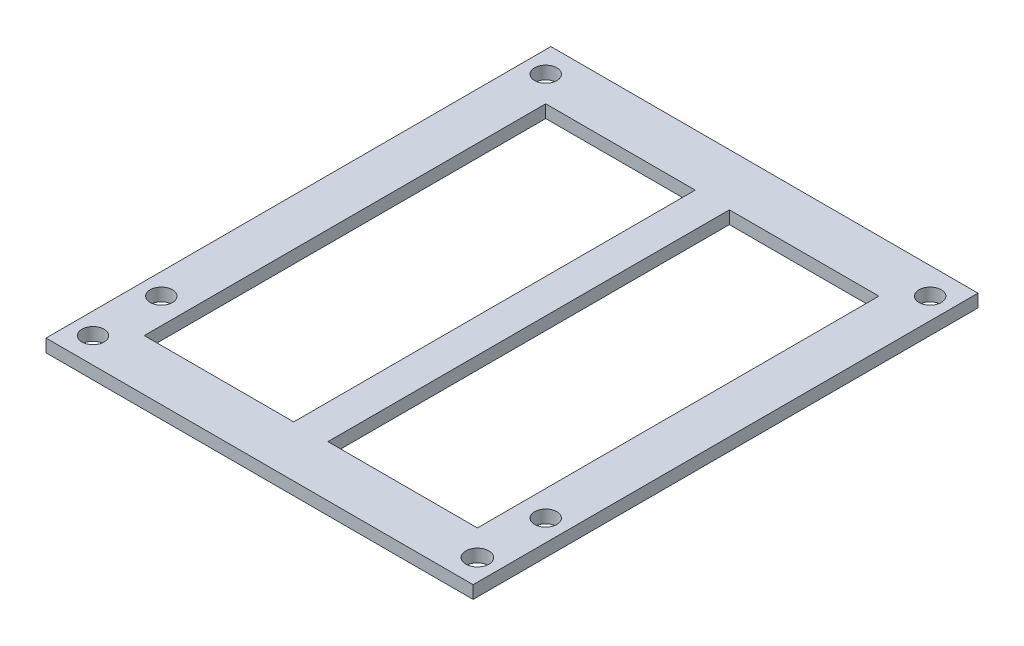
ISO-10303-21;
HEADER;
FILE_DESCRIPTION(('STEP AP214'),'2;1');
FILE_NAME('part.step','',(''),(''),'','','');
FILE_SCHEMA(('AUTOMOTIVE_DESIGN { 1 0 10303 214 1 1 1 1 }'));
ENDSEC;
DATA;
#1=APPLICATION_CONTEXT('core data for automotive mechanical design processes');
#2=APPLICATION_PROTOCOL_DEFINITION('international standard','automotive_design',2000,#1);
#3=PRODUCT_CONTEXT('',#1,'mechanical');
#4=PRODUCT('Part','Part','',(#3));
#5=PRODUCT_RELATED_PRODUCT_CATEGORY('part','',(#4));
#6=PRODUCT_DEFINITION_FORMATION('','',#4);
#7=PRODUCT_DEFINITION_CONTEXT('part definition',#1,'design');
#8=PRODUCT_DEFINITION('design','',#6,#7);
#9=PRODUCT_DEFINITION_SHAPE('','',#8);
#10=(LENGTH_UNIT() NAMED_UNIT(*) SI_UNIT(.MILLI.,.METRE.));
#11=(NAMED_UNIT(*) PLANE_ANGLE_UNIT() SI_UNIT($,.RADIAN.));
#12=(NAMED_UNIT(*) SI_UNIT($,.STERADIAN.) SOLID_ANGLE_UNIT());
#13=UNCERTAINTY_MEASURE_WITH_UNIT(LENGTH_MEASURE(1.E-05),#10,'distance_accuracy_value','');
#14=(GEOMETRIC_REPRESENTATION_CONTEXT(3) GLOBAL_UNCERTAINTY_ASSIGNED_CONTEXT((#13)) GLOBAL_UNIT_ASSIGNED_CONTEXT((#10,
#11,#12)) REPRESENTATION_CONTEXT('',''));
#15=CARTESIAN_POINT('',(0.,0.,0.));
#16=DIRECTION('',(0.,0.,1.));
#17=DIRECTION('',(1.,0.,0.));
#18=AXIS2_PLACEMENT_3D('',#15,#16,#17);
#19=CARTESIAN_POINT('',(0.,1.5,0.));
#20=DIRECTION('',(0.,-1.,0.));
#21=DIRECTION('',(0.,0.,-1.));
#22=AXIS2_PLACEMENT_3D('',#19,#20,#21);
#23=PLANE('',#22);
#24=CARTESIAN_POINT('',(22.5,1.5,-53.));
#25=DIRECTION('',(0.,1.,0.));
#26=DIRECTION('',(0.,0.,1.));
#27=AXIS2_PLACEMENT_3D('',#24,#25,#26);
#28=CIRCLE('',#27,1.3);
#29=CARTESIAN_POINT('',(22.5,1.5,-51.7));
#30=VERTEX_POINT('',#29);
#31=EDGE_CURVE('E160',#30,#30,#28,.T.);
#32=ORIENTED_EDGE('',*,*,#31,.F.);
#33=EDGE_LOOP('',(#32));
#34=FACE_BOUND('',#33,.T.);
#35=CARTESIAN_POINT('',(-22.5,1.5,-53.));
#36=DIRECTION('',(0.,1.,0.));
#37=DIRECTION('',(0.,0.,1.));
#38=AXIS2_PLACEMENT_3D('',#35,#36,#37);
#39=CIRCLE('',#38,1.3);
#40=CARTESIAN_POINT('',(-22.5,1.5,-51.7));
#41=VERTEX_POINT('',#40);
#42=EDGE_CURVE('E166',#41,#41,#39,.T.);
#43=ORIENTED_EDGE('',*,*,#42,.F.);
#44=EDGE_LOOP('',(#43));
#45=FACE_BOUND('',#44,.T.);
#46=CARTESIAN_POINT('',(22.5,1.5,-8.));
#47=DIRECTION('',(0.,1.,0.));
#48=DIRECTION('',(0.,0.,1.));
#49=AXIS2_PLACEMENT_3D('',#46,#47,#48);
#50=CIRCLE('',#49,1.3);
#51=CARTESIAN_POINT('',(22.5,1.5,-6.7));
#52=VERTEX_POINT('',#51);
#53=EDGE_CURVE('E172',#52,#52,#50,.T.);
#54=ORIENTED_EDGE('',*,*,#53,.F.);
#55=EDGE_LOOP('',(#54));
#56=FACE_BOUND('',#55,.T.);
#57=CARTESIAN_POINT('',(-22.5,1.5,-8.));
#58=DIRECTION('',(0.,1.,0.));
#59=DIRECTION('',(0.,0.,1.));
#60=AXIS2_PLACEMENT_3D('',#57,#58,#59);
#61=CIRCLE('',#60,1.3);
#62=CARTESIAN_POINT('',(-22.5,1.5,-6.7));
#63=VERTEX_POINT('',#62);
#64=EDGE_CURVE('E178',#63,#63,#61,.T.);
#65=ORIENTED_EDGE('',*,*,#64,.F.);
#66=EDGE_LOOP('',(#65));
#67=FACE_BOUND('',#66,.T.);
#68=DIRECTION('',(1.,0.,0.));
#69=VECTOR('',#68,1.);
#70=CARTESIAN_POINT('',(-19.5,1.5,-3.));
#71=LINE('',#70,#69);
#72=CARTESIAN_POINT('',(-19.5,1.5,-3.));
#73=VERTEX_POINT('',#72);
#74=CARTESIAN_POINT('',(-2.,1.5,-3.));
#75=VERTEX_POINT('',#74);
#76=EDGE_CURVE('E184',#73,#75,#71,.T.);
#77=ORIENTED_EDGE('',*,*,#76,.F.);
#78=DIRECTION('',(0.,0.,1.));
#79=VECTOR('',#78,1.);
#80=CARTESIAN_POINT('',(-19.5,1.5,-3.));
#81=LINE('',#80,#79);
#82=CARTESIAN_POINT('',(-19.5,1.5,-50.));
#83=VERTEX_POINT('',#82);
#84=EDGE_CURVE('E192',#83,#73,#81,.T.);
#85=ORIENTED_EDGE('',*,*,#84,.F.);
#86=DIRECTION('',(-1.,0.,0.));
#87=VECTOR('',#86,1.);
#88=CARTESIAN_POINT('',(-2.,1.5,-50.));
#89=LINE('',#88,#87);
#90=CARTESIAN_POINT('',(-2.,1.5,-50.));
#91=VERTEX_POINT('',#90);
#92=EDGE_CURVE('E189',#91,#83,#89,.T.);
#93=ORIENTED_EDGE('',*,*,#92,.F.);
#94=DIRECTION('',(0.,0.,-1.));
#95=VECTOR('',#94,1.);
#96=CARTESIAN_POINT('',(-2.,1.5,-50.));
#97=LINE('',#96,#95);
#98=EDGE_CURVE('E186',#75,#91,#97,.T.);
#99=ORIENTED_EDGE('',*,*,#98,.F.);
#100=EDGE_LOOP('',(#77,#85,#93,#99));
#101=FACE_BOUND('',#100,.T.);
#102=DIRECTION('',(0.,0.,-1.));
#103=VECTOR('',#102,1.);
#104=CARTESIAN_POINT('',(25.,1.5,-56.1033523698713));
#105=LINE('',#104,#103);
#106=CARTESIAN_POINT('',(25.,1.5,3.));
#107=VERTEX_POINT('',#106);
#108=CARTESIAN_POINT('',(25.,1.5,-56.1033523698713));
#109=VERTEX_POINT('',#108);
#110=EDGE_CURVE('E227',#107,#109,#105,.T.);
#111=ORIENTED_EDGE('',*,*,#110,.T.);
#112=DIRECTION('',(-1.,0.,0.));
#113=VECTOR('',#112,1.);
#114=CARTESIAN_POINT('',(-25.,1.5,-56.1033523698713));
#115=LINE('',#114,#113);
#116=CARTESIAN_POINT('',(-25.,1.5,-56.1033523698713));
#117=VERTEX_POINT('',#116);
#118=EDGE_CURVE('E230',#109,#117,#115,.T.);
#119=ORIENTED_EDGE('',*,*,#118,.T.);
#120=DIRECTION('',(0.,0.,1.));
#121=VECTOR('',#120,1.);
#122=CARTESIAN_POINT('',(-25.,1.5,-11.));
#123=LINE('',#122,#121);
#124=CARTESIAN_POINT('',(-25.,1.5,3.00000000000001));
#125=VERTEX_POINT('',#124);
#126=EDGE_CURVE('E233',#117,#125,#123,.T.);
#127=ORIENTED_EDGE('',*,*,#126,.T.);
#128=DIRECTION('',(1.,0.,0.));
#129=VECTOR('',#128,1.);
#130=CARTESIAN_POINT('',(25.,1.5,3.));
#131=LINE('',#130,#129);
#132=EDGE_CURVE('E235',#125,#107,#131,.T.);
#133=ORIENTED_EDGE('',*,*,#132,.T.);
#134=EDGE_LOOP('',(#111,#119,#127,#133));
#135=FACE_BOUND('',#134,.T.);
#136=CARTESIAN_POINT('',(22.5,1.5,0.));
#137=DIRECTION('',(0.,1.,0.));
#138=DIRECTION('',(0.,0.,1.));
#139=AXIS2_PLACEMENT_3D('',#136,#137,#138);
#140=CIRCLE('',#139,1.35);
#141=CARTESIAN_POINT('',(22.5,1.5,1.35));
#142=VERTEX_POINT('',#141);
#143=EDGE_CURVE('E221',#142,#142,#140,.T.);
#144=ORIENTED_EDGE('',*,*,#143,.F.);
#145=EDGE_LOOP('',(#144));
#146=FACE_BOUND('',#145,.T.);
#147=CARTESIAN_POINT('',(-22.5,1.5,0.));
#148=DIRECTION('',(0.,1.,0.));
#149=DIRECTION('',(0.,0.,1.));
#150=AXIS2_PLACEMENT_3D('',#147,#148,#149);
#151=CIRCLE('',#150,1.3);
#152=CARTESIAN_POINT('',(-22.5,1.5,1.3));
#153=VERTEX_POINT('',#152);
#154=EDGE_CURVE('E215',#153,#153,#151,.T.);
#155=ORIENTED_EDGE('',*,*,#154,.F.);
#156=EDGE_LOOP('',(#155));
#157=FACE_BOUND('',#156,.T.);
#158=DIRECTION('',(0.,0.,1.));
#159=VECTOR('',#158,1.);
#160=CARTESIAN_POINT('',(2.,1.5,-3.));
#161=LINE('',#160,#159);
#162=CARTESIAN_POINT('',(2.,1.5,-50.));
#163=VERTEX_POINT('',#162);
#164=CARTESIAN_POINT('',(2.,1.5,-3.));
#165=VERTEX_POINT('',#164);
#166=EDGE_CURVE('E124',#163,#165,#161,.T.);
#167=ORIENTED_EDGE('',*,*,#166,.F.);
#168=DIRECTION('',(-1.,0.,0.));
#169=VECTOR('',#168,1.);
#170=CARTESIAN_POINT('',(2.,1.5,-50.));
#171=LINE('',#170,#169);
#172=CARTESIAN_POINT('',(19.5,1.5,-50.));
#173=VERTEX_POINT('',#172);
#174=EDGE_CURVE('E146',#173,#163,#171,.T.);
#175=ORIENTED_EDGE('',*,*,#174,.F.);
#176=DIRECTION('',(0.,0.,-1.));
#177=VECTOR('',#176,1.);
#178=CARTESIAN_POINT('',(19.5,1.5,-3.));
#179=LINE('',#178,#177);
#180=CARTESIAN_POINT('',(19.5,1.5,-3.));
#181=VERTEX_POINT('',#180);
#182=EDGE_CURVE('E144',#181,#173,#179,.T.);
#183=ORIENTED_EDGE('',*,*,#182,.F.);
#184=DIRECTION('',(1.,0.,0.));
#185=VECTOR('',#184,1.);
#186=CARTESIAN_POINT('',(2.,1.5,-3.));
#187=LINE('',#186,#185);
#188=EDGE_CURVE('E132',#165,#181,#187,.T.);
#189=ORIENTED_EDGE('',*,*,#188,.F.);
#190=EDGE_LOOP('',(#167,#175,#183,#189));
#191=FACE_BOUND('',#190,.T.);
#192=ADVANCED_FACE('F35',(#34,#45,#56,#67,#101,#135,#146,#157,#191),#23,.F.);
#193=CARTESIAN_POINT('',(0.,0.,0.));
#194=DIRECTION('',(0.,-1.,0.));
#195=DIRECTION('',(0.,0.,-1.));
#196=AXIS2_PLACEMENT_3D('',#193,#194,#195);
#197=PLANE('',#196);
#198=CARTESIAN_POINT('',(-22.5,0.,-53.));
#199=DIRECTION('',(0.,1.,0.));
#200=DIRECTION('',(0.,0.,1.));
#201=AXIS2_PLACEMENT_3D('',#198,#199,#200);
#202=CIRCLE('',#201,1.3);
#203=CARTESIAN_POINT('',(-22.5,0.,-51.7));
#204=VERTEX_POINT('',#203);
#205=EDGE_CURVE('E163',#204,#204,#202,.T.);
#206=ORIENTED_EDGE('',*,*,#205,.T.);
#207=EDGE_LOOP('',(#206));
#208=FACE_BOUND('',#207,.T.);
#209=CARTESIAN_POINT('',(-22.5,0.,-8.));
#210=DIRECTION('',(0.,1.,0.));
#211=DIRECTION('',(0.,0.,1.));
#212=AXIS2_PLACEMENT_3D('',#209,#210,#211);
#213=CIRCLE('',#212,1.3);
#214=CARTESIAN_POINT('',(-22.5,0.,-6.7));
#215=VERTEX_POINT('',#214);
#216=EDGE_CURVE('E175',#215,#215,#213,.T.);
#217=ORIENTED_EDGE('',*,*,#216,.T.);
#218=EDGE_LOOP('',(#217));
#219=FACE_BOUND('',#218,.T.);
#220=CARTESIAN_POINT('',(22.5,0.,0.));
#221=DIRECTION('',(0.,1.,0.));
#222=DIRECTION('',(0.,0.,1.));
#223=AXIS2_PLACEMENT_3D('',#220,#221,#222);
#224=CIRCLE('',#223,1.35);
#225=CARTESIAN_POINT('',(22.5,0.,1.35));
#226=VERTEX_POINT('',#225);
#227=EDGE_CURVE('E218',#226,#226,#224,.T.);
#228=ORIENTED_EDGE('',*,*,#227,.T.);
#229=EDGE_LOOP('',(#228));
#230=FACE_BOUND('',#229,.T.);
#231=DIRECTION('',(-1.,0.,0.));
#232=VECTOR('',#231,1.);
#233=CARTESIAN_POINT('',(-25.,0.,-56.1033523698713));
#234=LINE('',#233,#232);
#235=CARTESIAN_POINT('',(25.,0.,-56.1033523698713));
#236=VERTEX_POINT('',#235);
#237=CARTESIAN_POINT('',(-25.,0.,-56.1033523698713));
#238=VERTEX_POINT('',#237);
#239=EDGE_CURVE('E224',#236,#238,#234,.T.);
#240=ORIENTED_EDGE('',*,*,#239,.F.);
#241=DIRECTION('',(0.,0.,-1.));
#242=VECTOR('',#241,1.);
#243=CARTESIAN_POINT('',(25.,0.,-11.));
#244=LINE('',#243,#242);
#245=CARTESIAN_POINT('',(25.,0.,3.));
#246=VERTEX_POINT('',#245);
#247=EDGE_CURVE('E231',#246,#236,#244,.T.);
#248=ORIENTED_EDGE('',*,*,#247,.F.);
#249=DIRECTION('',(1.,0.,0.));
#250=VECTOR('',#249,1.);
#251=CARTESIAN_POINT('',(25.,0.,3.));
#252=LINE('',#251,#250);
#253=CARTESIAN_POINT('',(-25.,0.,3.00000000000001));
#254=VERTEX_POINT('',#253);
#255=EDGE_CURVE('E243',#254,#246,#252,.T.);
#256=ORIENTED_EDGE('',*,*,#255,.F.);
#257=DIRECTION('',(0.,0.,1.));
#258=VECTOR('',#257,1.);
#259=CARTESIAN_POINT('',(-25.,0.,3.00000000000001));
#260=LINE('',#259,#258);
#261=EDGE_CURVE('E241',#238,#254,#260,.T.);
#262=ORIENTED_EDGE('',*,*,#261,.F.);
#263=EDGE_LOOP('',(#240,#248,#256,#262));
#264=FACE_BOUND('',#263,.T.);
#265=CARTESIAN_POINT('',(-22.5,0.,0.));
#266=DIRECTION('',(0.,1.,0.));
#267=DIRECTION('',(0.,0.,1.));
#268=AXIS2_PLACEMENT_3D('',#265,#266,#267);
#269=CIRCLE('',#268,1.3);
#270=CARTESIAN_POINT('',(-22.5,0.,1.3));
#271=VERTEX_POINT('',#270);
#272=EDGE_CURVE('E214',#271,#271,#269,.T.);
#273=ORIENTED_EDGE('',*,*,#272,.T.);
#274=EDGE_LOOP('',(#273));
#275=FACE_BOUND('',#274,.T.);
#276=DIRECTION('',(0.,0.,1.));
#277=VECTOR('',#276,1.);
#278=CARTESIAN_POINT('',(-19.5,0.,-3.));
#279=LINE('',#278,#277);
#280=CARTESIAN_POINT('',(-19.5,0.,-50.));
#281=VERTEX_POINT('',#280);
#282=CARTESIAN_POINT('',(-19.5,0.,-3.));
#283=VERTEX_POINT('',#282);
#284=EDGE_CURVE('E187',#281,#283,#279,.T.);
#285=ORIENTED_EDGE('',*,*,#284,.T.);
#286=DIRECTION('',(1.,0.,0.));
#287=VECTOR('',#286,1.);
#288=CARTESIAN_POINT('',(-19.5,0.,-3.));
#289=LINE('',#288,#287);
#290=CARTESIAN_POINT('',(-2.,0.,-3.));
#291=VERTEX_POINT('',#290);
#292=EDGE_CURVE('E181',#283,#291,#289,.T.);
#293=ORIENTED_EDGE('',*,*,#292,.T.);
#294=DIRECTION('',(0.,0.,-1.));
#295=VECTOR('',#294,1.);
#296=CARTESIAN_POINT('',(-2.,0.,-50.));
#297=LINE('',#296,#295);
#298=CARTESIAN_POINT('',(-2.,0.,-50.));
#299=VERTEX_POINT('',#298);
#300=EDGE_CURVE('E197',#291,#299,#297,.T.);
#301=ORIENTED_EDGE('',*,*,#300,.T.);
#302=DIRECTION('',(-1.,0.,0.));
#303=VECTOR('',#302,1.);
#304=CARTESIAN_POINT('',(-2.,0.,-50.));
#305=LINE('',#304,#303);
#306=EDGE_CURVE('E200',#299,#281,#305,.T.);
#307=ORIENTED_EDGE('',*,*,#306,.T.);
#308=EDGE_LOOP('',(#285,#293,#301,#307));
#309=FACE_BOUND('',#308,.T.);
#310=CARTESIAN_POINT('',(22.5,0.,-8.));
#311=DIRECTION('',(0.,1.,0.));
#312=DIRECTION('',(0.,0.,1.));
#313=AXIS2_PLACEMENT_3D('',#310,#311,#312);
#314=CIRCLE('',#313,1.3);
#315=CARTESIAN_POINT('',(22.5,0.,-6.7));
#316=VERTEX_POINT('',#315);
#317=EDGE_CURVE('E169',#316,#316,#314,.T.);
#318=ORIENTED_EDGE('',*,*,#317,.T.);
#319=EDGE_LOOP('',(#318));
#320=FACE_BOUND('',#319,.T.);
#321=CARTESIAN_POINT('',(22.5,0.,-53.));
#322=DIRECTION('',(0.,1.,0.));
#323=DIRECTION('',(0.,0.,1.));
#324=AXIS2_PLACEMENT_3D('',#321,#322,#323);
#325=CIRCLE('',#324,1.3);
#326=CARTESIAN_POINT('',(22.5,0.,-51.7));
#327=VERTEX_POINT('',#326);
#328=EDGE_CURVE('E140',#327,#327,#325,.T.);
#329=ORIENTED_EDGE('',*,*,#328,.T.);
#330=EDGE_LOOP('',(#329));
#331=FACE_BOUND('',#330,.T.);
#332=DIRECTION('',(-1.,0.,0.));
#333=VECTOR('',#332,1.);
#334=CARTESIAN_POINT('',(2.,0.,-50.));
#335=LINE('',#334,#333);
#336=CARTESIAN_POINT('',(19.5,0.,-50.));
#337=VERTEX_POINT('',#336);
#338=CARTESIAN_POINT('',(2.,0.,-50.));
#339=VERTEX_POINT('',#338);
#340=EDGE_CURVE('E133',#337,#339,#335,.T.);
#341=ORIENTED_EDGE('',*,*,#340,.T.);
#342=DIRECTION('',(0.,0.,1.));
#343=VECTOR('',#342,1.);
#344=CARTESIAN_POINT('',(2.,0.,-3.));
#345=LINE('',#344,#343);
#346=CARTESIAN_POINT('',(2.,0.,-3.));
#347=VERTEX_POINT('',#346);
#348=EDGE_CURVE('E58',#339,#347,#345,.T.);
#349=ORIENTED_EDGE('',*,*,#348,.T.);
#350=DIRECTION('',(1.,0.,0.));
#351=VECTOR('',#350,1.);
#352=CARTESIAN_POINT('',(2.,0.,-3.));
#353=LINE('',#352,#351);
#354=CARTESIAN_POINT('',(19.5,0.,-3.));
#355=VERTEX_POINT('',#354);
#356=EDGE_CURVE('E139',#347,#355,#353,.T.);
#357=ORIENTED_EDGE('',*,*,#356,.T.);
#358=DIRECTION('',(0.,0.,-1.));
#359=VECTOR('',#358,1.);
#360=CARTESIAN_POINT('',(19.5,0.,-3.));
#361=LINE('',#360,#359);
#362=EDGE_CURVE('E152',#355,#337,#361,.T.);
#363=ORIENTED_EDGE('',*,*,#362,.T.);
#364=EDGE_LOOP('',(#341,#349,#357,#363));
#365=FACE_BOUND('',#364,.T.);
#366=ADVANCED_FACE('F261',(#208,#219,#230,#264,#275,#309,#320,#331,#365),#197,.T.);
#367=CARTESIAN_POINT('',(-25.,1.5,-56.1033523698713));
#368=DIRECTION('',(0.,0.,1.));
#369=DIRECTION('',(1.,0.,0.));
#370=AXIS2_PLACEMENT_3D('',#367,#368,#369);
#371=PLANE('',#370);
#372=ORIENTED_EDGE('',*,*,#239,.T.);
#373=DIRECTION('',(0.,-1.,0.));
#374=VECTOR('',#373,1.);
#375=CARTESIAN_POINT('',(-25.,1.5,-56.1033523698713));
#376=LINE('',#375,#374);
#377=EDGE_CURVE('E43',#117,#238,#376,.T.);
#378=ORIENTED_EDGE('',*,*,#377,.F.);
#379=ORIENTED_EDGE('',*,*,#118,.F.);
#380=DIRECTION('',(0.,-1.,0.));
#381=VECTOR('',#380,1.);
#382=CARTESIAN_POINT('',(25.,1.5,-56.1033523698713));
#383=LINE('',#382,#381);
#384=EDGE_CURVE('E11',#109,#236,#383,.T.);
#385=ORIENTED_EDGE('',*,*,#384,.T.);
#386=EDGE_LOOP('',(#372,#378,#379,#385));
#387=FACE_BOUND('',#386,.T.);
#388=ADVANCED_FACE('F37',(#387),#371,.F.);
#389=CARTESIAN_POINT('',(-25.,1.5,3.00000000000001));
#390=DIRECTION('',(1.,0.,0.));
#391=DIRECTION('',(0.,0.,-1.));
#392=AXIS2_PLACEMENT_3D('',#389,#390,#391);
#393=PLANE('',#392);
#394=ORIENTED_EDGE('',*,*,#261,.T.);
#395=DIRECTION('',(0.,-1.,0.));
#396=VECTOR('',#395,1.);
#397=CARTESIAN_POINT('',(-25.,1.5,3.00000000000001));
#398=LINE('',#397,#396);
#399=EDGE_CURVE('E248',#125,#254,#398,.T.);
#400=ORIENTED_EDGE('',*,*,#399,.F.);
#401=ORIENTED_EDGE('',*,*,#126,.F.);
#402=ORIENTED_EDGE('',*,*,#377,.T.);
#403=EDGE_LOOP('',(#394,#400,#401,#402));
#404=FACE_BOUND('',#403,.T.);
#405=ADVANCED_FACE('F254',(#404),#393,.F.);
#406=CARTESIAN_POINT('',(25.,1.5,3.));
#407=DIRECTION('',(0.,0.,-1.));
#408=DIRECTION('',(-1.,0.,0.));
#409=AXIS2_PLACEMENT_3D('',#406,#407,#408);
#410=PLANE('',#409);
#411=ORIENTED_EDGE('',*,*,#255,.T.);
#412=DIRECTION('',(0.,-1.,0.));
#413=VECTOR('',#412,1.);
#414=CARTESIAN_POINT('',(25.,1.5,3.));
#415=LINE('',#414,#413);
#416=EDGE_CURVE('E238',#107,#246,#415,.T.);
#417=ORIENTED_EDGE('',*,*,#416,.F.);
#418=ORIENTED_EDGE('',*,*,#132,.F.);
#419=ORIENTED_EDGE('',*,*,#399,.T.);
#420=EDGE_LOOP('',(#411,#417,#418,#419));
#421=FACE_BOUND('',#420,.T.);
#422=ADVANCED_FACE('F266',(#421),#410,.F.);
#423=CARTESIAN_POINT('',(25.,1.5,-11.));
#424=DIRECTION('',(-1.,0.,0.));
#425=DIRECTION('',(0.,0.,1.));
#426=AXIS2_PLACEMENT_3D('',#423,#424,#425);
#427=PLANE('',#426);
#428=ORIENTED_EDGE('',*,*,#247,.T.);
#429=ORIENTED_EDGE('',*,*,#384,.F.);
#430=ORIENTED_EDGE('',*,*,#110,.F.);
#431=ORIENTED_EDGE('',*,*,#416,.T.);
#432=EDGE_LOOP('',(#428,#429,#430,#431));
#433=FACE_BOUND('',#432,.T.);
#434=ADVANCED_FACE('F269',(#433),#427,.F.);
#435=CARTESIAN_POINT('',(22.5,1.5,0.));
#436=DIRECTION('',(0.,-1.,0.));
#437=DIRECTION('',(0.,0.,-1.));
#438=AXIS2_PLACEMENT_3D('',#435,#436,#437);
#439=CYLINDRICAL_SURFACE('',#438,1.35);
#440=ORIENTED_EDGE('',*,*,#143,.T.);
#441=EDGE_LOOP('',(#440));
#442=FACE_BOUND('',#441,.T.);
#443=ORIENTED_EDGE('',*,*,#227,.F.);
#444=EDGE_LOOP('',(#443));
#445=FACE_BOUND('',#444,.T.);
#446=ADVANCED_FACE('F283',(#442,#445),#439,.F.);
#447=CARTESIAN_POINT('',(-22.5,1.5,0.));
#448=DIRECTION('',(0.,-1.,0.));
#449=DIRECTION('',(0.,0.,-1.));
#450=AXIS2_PLACEMENT_3D('',#447,#448,#449);
#451=CYLINDRICAL_SURFACE('',#450,1.3);
#452=ORIENTED_EDGE('',*,*,#154,.T.);
#453=EDGE_LOOP('',(#452));
#454=FACE_BOUND('',#453,.T.);
#455=ORIENTED_EDGE('',*,*,#272,.F.);
#456=EDGE_LOOP('',(#455));
#457=FACE_BOUND('',#456,.T.);
#458=ADVANCED_FACE('F279',(#454,#457),#451,.F.);
#459=CARTESIAN_POINT('',(-19.5,1.5,-3.));
#460=DIRECTION('',(0.,0.,-1.));
#461=DIRECTION('',(-1.,0.,0.));
#462=AXIS2_PLACEMENT_3D('',#459,#460,#461);
#463=PLANE('',#462);
#464=ORIENTED_EDGE('',*,*,#292,.F.);
#465=DIRECTION('',(0.,-1.,0.));
#466=VECTOR('',#465,1.);
#467=CARTESIAN_POINT('',(-19.5,1.5,-3.));
#468=LINE('',#467,#466);
#469=EDGE_CURVE('E194',#73,#283,#468,.T.);
#470=ORIENTED_EDGE('',*,*,#469,.F.);
#471=ORIENTED_EDGE('',*,*,#76,.T.);
#472=DIRECTION('',(0.,-1.,0.));
#473=VECTOR('',#472,1.);
#474=CARTESIAN_POINT('',(-2.,1.5,-3.));
#475=LINE('',#474,#473);
#476=EDGE_CURVE('E211',#75,#291,#475,.T.);
#477=ORIENTED_EDGE('',*,*,#476,.T.);
#478=EDGE_LOOP('',(#464,#470,#471,#477));
#479=FACE_BOUND('',#478,.T.);
#480=ADVANCED_FACE('F282',(#479),#463,.T.);
#481=CARTESIAN_POINT('',(-2.,1.5,-50.));
#482=DIRECTION('',(-1.,0.,0.));
#483=DIRECTION('',(0.,0.,1.));
#484=AXIS2_PLACEMENT_3D('',#481,#482,#483);
#485=PLANE('',#484);
#486=ORIENTED_EDGE('',*,*,#300,.F.);
#487=ORIENTED_EDGE('',*,*,#476,.F.);
#488=ORIENTED_EDGE('',*,*,#98,.T.);
#489=DIRECTION('',(0.,-1.,0.));
#490=VECTOR('',#489,1.);
#491=CARTESIAN_POINT('',(-2.,1.5,-50.));
#492=LINE('',#491,#490);
#493=EDGE_CURVE('E209',#91,#299,#492,.T.);
#494=ORIENTED_EDGE('',*,*,#493,.T.);
#495=EDGE_LOOP('',(#486,#487,#488,#494));
#496=FACE_BOUND('',#495,.T.);
#497=ADVANCED_FACE('F334',(#496),#485,.T.);
#498=CARTESIAN_POINT('',(-2.,1.5,-50.));
#499=DIRECTION('',(0.,0.,1.));
#500=DIRECTION('',(1.,0.,0.));
#501=AXIS2_PLACEMENT_3D('',#498,#499,#500);
#502=PLANE('',#501);
#503=ORIENTED_EDGE('',*,*,#306,.F.);
#504=ORIENTED_EDGE('',*,*,#493,.F.);
#505=ORIENTED_EDGE('',*,*,#92,.T.);
#506=DIRECTION('',(0.,-1.,0.));
#507=VECTOR('',#506,1.);
#508=CARTESIAN_POINT('',(-19.5,1.5,-50.));
#509=LINE('',#508,#507);
#510=EDGE_CURVE('E207',#83,#281,#509,.T.);
#511=ORIENTED_EDGE('',*,*,#510,.T.);
#512=EDGE_LOOP('',(#503,#504,#505,#511));
#513=FACE_BOUND('',#512,.T.);
#514=ADVANCED_FACE('F330',(#513),#502,.T.);
#515=CARTESIAN_POINT('',(-19.5,1.5,-3.));
#516=DIRECTION('',(1.,0.,0.));
#517=DIRECTION('',(0.,0.,-1.));
#518=AXIS2_PLACEMENT_3D('',#515,#516,#517);
#519=PLANE('',#518);
#520=ORIENTED_EDGE('',*,*,#284,.F.);
#521=ORIENTED_EDGE('',*,*,#510,.F.);
#522=ORIENTED_EDGE('',*,*,#84,.T.);
#523=ORIENTED_EDGE('',*,*,#469,.T.);
#524=EDGE_LOOP('',(#520,#521,#522,#523));
#525=FACE_BOUND('',#524,.T.);
#526=ADVANCED_FACE('F326',(#525),#519,.T.);
#527=CARTESIAN_POINT('',(-22.5,1.5,-8.));
#528=DIRECTION('',(0.,-1.,0.));
#529=DIRECTION('',(0.,0.,-1.));
#530=AXIS2_PLACEMENT_3D('',#527,#528,#529);
#531=CYLINDRICAL_SURFACE('',#530,1.3);
#532=ORIENTED_EDGE('',*,*,#64,.T.);
#533=EDGE_LOOP('',(#532));
#534=FACE_BOUND('',#533,.T.);
#535=ORIENTED_EDGE('',*,*,#216,.F.);
#536=EDGE_LOOP('',(#535));
#537=FACE_BOUND('',#536,.T.);
#538=ADVANCED_FACE('F322',(#534,#537),#531,.F.);
#539=CARTESIAN_POINT('',(22.5,1.5,-8.));
#540=DIRECTION('',(0.,-1.,0.));
#541=DIRECTION('',(0.,0.,-1.));
#542=AXIS2_PLACEMENT_3D('',#539,#540,#541);
#543=CYLINDRICAL_SURFACE('',#542,1.3);
#544=ORIENTED_EDGE('',*,*,#53,.T.);
#545=EDGE_LOOP('',(#544));
#546=FACE_BOUND('',#545,.T.);
#547=ORIENTED_EDGE('',*,*,#317,.F.);
#548=EDGE_LOOP('',(#547));
#549=FACE_BOUND('',#548,.T.);
#550=ADVANCED_FACE('F318',(#546,#549),#543,.F.);
#551=CARTESIAN_POINT('',(-22.5,1.5,-53.));
#552=DIRECTION('',(0.,-1.,0.));
#553=DIRECTION('',(0.,0.,-1.));
#554=AXIS2_PLACEMENT_3D('',#551,#552,#553);
#555=CYLINDRICAL_SURFACE('',#554,1.3);
#556=ORIENTED_EDGE('',*,*,#42,.T.);
#557=EDGE_LOOP('',(#556));
#558=FACE_BOUND('',#557,.T.);
#559=ORIENTED_EDGE('',*,*,#205,.F.);
#560=EDGE_LOOP('',(#559));
#561=FACE_BOUND('',#560,.T.);
#562=ADVANCED_FACE('F314',(#558,#561),#555,.F.);
#563=CARTESIAN_POINT('',(22.5,1.5,-53.));
#564=DIRECTION('',(0.,-1.,0.));
#565=DIRECTION('',(0.,0.,-1.));
#566=AXIS2_PLACEMENT_3D('',#563,#564,#565);
#567=CYLINDRICAL_SURFACE('',#566,1.3);
#568=ORIENTED_EDGE('',*,*,#31,.T.);
#569=EDGE_LOOP('',(#568));
#570=FACE_BOUND('',#569,.T.);
#571=ORIENTED_EDGE('',*,*,#328,.F.);
#572=EDGE_LOOP('',(#571));
#573=FACE_BOUND('',#572,.T.);
#574=ADVANCED_FACE('F311',(#570,#573),#567,.F.);
#575=CARTESIAN_POINT('',(2.,1.5,-3.));
#576=DIRECTION('',(1.,0.,0.));
#577=DIRECTION('',(0.,0.,-1.));
#578=AXIS2_PLACEMENT_3D('',#575,#576,#577);
#579=PLANE('',#578);
#580=ORIENTED_EDGE('',*,*,#348,.F.);
#581=DIRECTION('',(0.,-1.,0.));
#582=VECTOR('',#581,1.);
#583=CARTESIAN_POINT('',(2.,1.5,-50.));
#584=LINE('',#583,#582);
#585=EDGE_CURVE('E128',#163,#339,#584,.T.);
#586=ORIENTED_EDGE('',*,*,#585,.F.);
#587=ORIENTED_EDGE('',*,*,#166,.T.);
#588=DIRECTION('',(0.,-1.,0.));
#589=VECTOR('',#588,1.);
#590=CARTESIAN_POINT('',(2.,1.5,-3.));
#591=LINE('',#590,#589);
#592=EDGE_CURVE('E127',#165,#347,#591,.T.);
#593=ORIENTED_EDGE('',*,*,#592,.T.);
#594=EDGE_LOOP('',(#580,#586,#587,#593));
#595=FACE_BOUND('',#594,.T.);
#596=ADVANCED_FACE('F126',(#595),#579,.T.);
#597=CARTESIAN_POINT('',(2.,1.5,-3.));
#598=DIRECTION('',(0.,0.,-1.));
#599=DIRECTION('',(-1.,0.,0.));
#600=AXIS2_PLACEMENT_3D('',#597,#598,#599);
#601=PLANE('',#600);
#602=ORIENTED_EDGE('',*,*,#356,.F.);
#603=ORIENTED_EDGE('',*,*,#592,.F.);
#604=ORIENTED_EDGE('',*,*,#188,.T.);
#605=DIRECTION('',(0.,-1.,0.));
#606=VECTOR('',#605,1.);
#607=CARTESIAN_POINT('',(19.5,1.5,-3.));
#608=LINE('',#607,#606);
#609=EDGE_CURVE('E141',#181,#355,#608,.T.);
#610=ORIENTED_EDGE('',*,*,#609,.T.);
#611=EDGE_LOOP('',(#602,#603,#604,#610));
#612=FACE_BOUND('',#611,.T.);
#613=ADVANCED_FACE('F136',(#612),#601,.T.);
#614=CARTESIAN_POINT('',(19.5,1.5,-3.));
#615=DIRECTION('',(-1.,0.,0.));
#616=DIRECTION('',(0.,0.,1.));
#617=AXIS2_PLACEMENT_3D('',#614,#615,#616);
#618=PLANE('',#617);
#619=ORIENTED_EDGE('',*,*,#362,.F.);
#620=ORIENTED_EDGE('',*,*,#609,.F.);
#621=ORIENTED_EDGE('',*,*,#182,.T.);
#622=DIRECTION('',(0.,-1.,0.));
#623=VECTOR('',#622,1.);
#624=CARTESIAN_POINT('',(19.5,1.5,-50.));
#625=LINE('',#624,#623);
#626=EDGE_CURVE('E50',#173,#337,#625,.T.);
#627=ORIENTED_EDGE('',*,*,#626,.T.);
#628=EDGE_LOOP('',(#619,#620,#621,#627));
#629=FACE_BOUND('',#628,.T.);
#630=ADVANCED_FACE('F299',(#629),#618,.T.);
#631=CARTESIAN_POINT('',(2.,1.5,-50.));
#632=DIRECTION('',(0.,0.,1.));
#633=DIRECTION('',(1.,0.,0.));
#634=AXIS2_PLACEMENT_3D('',#631,#632,#633);
#635=PLANE('',#634);
#636=ORIENTED_EDGE('',*,*,#340,.F.);
#637=ORIENTED_EDGE('',*,*,#626,.F.);
#638=ORIENTED_EDGE('',*,*,#174,.T.);
#639=ORIENTED_EDGE('',*,*,#585,.T.);
#640=EDGE_LOOP('',(#636,#637,#638,#639));
#641=FACE_BOUND('',#640,.T.);
#642=ADVANCED_FACE('F297',(#641),#635,.T.);
#643=CLOSED_SHELL('',(#192,#366,#388,#405,#422,#434,#446,#458,#480,#497,#514,#526,#538,#550,
#562,#574,#596,#613,#630,#642));
#644=MANIFOLD_SOLID_BREP('B2',#643);
#645=ADVANCED_BREP_SHAPE_REPRESENTATION('',(#18,#644),#14);
#646=SHAPE_DEFINITION_REPRESENTATION(#9,#645);
ENDSEC;
END-ISO-10303-21;
